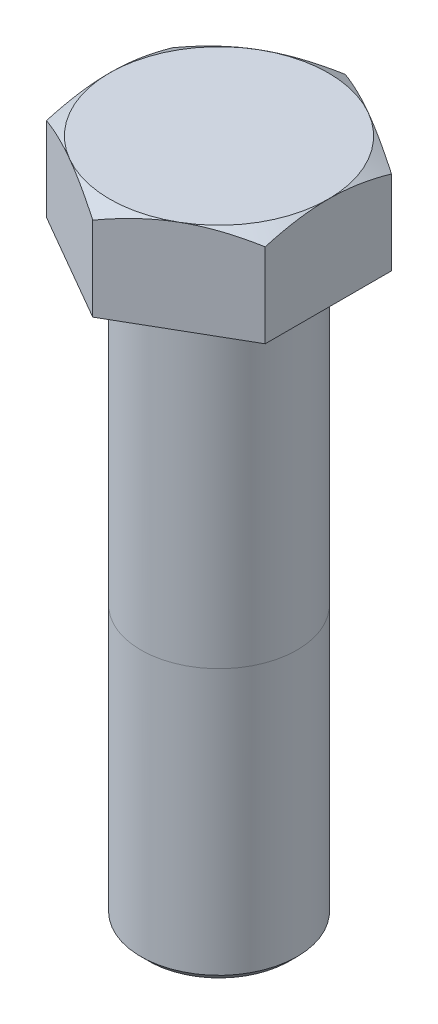
ISO-10303-21;
HEADER;
FILE_DESCRIPTION(('STEP AP214'),'2;1');
FILE_NAME('part.step','',(''),(''),'','','');
FILE_SCHEMA(('AUTOMOTIVE_DESIGN { 1 0 10303 214 1 1 1 1 }'));
ENDSEC;
DATA;
#1=APPLICATION_CONTEXT('core data for automotive mechanical design processes');
#2=APPLICATION_PROTOCOL_DEFINITION('international standard','automotive_design',2000,#1);
#3=PRODUCT_CONTEXT('',#1,'mechanical');
#4=PRODUCT('Part','Part','',(#3));
#5=PRODUCT_RELATED_PRODUCT_CATEGORY('part','',(#4));
#6=PRODUCT_DEFINITION_FORMATION('','',#4);
#7=PRODUCT_DEFINITION_CONTEXT('part definition',#1,'design');
#8=PRODUCT_DEFINITION('design','',#6,#7);
#9=PRODUCT_DEFINITION_SHAPE('','',#8);
#10=(LENGTH_UNIT() NAMED_UNIT(*) SI_UNIT(.MILLI.,.METRE.));
#11=(NAMED_UNIT(*) PLANE_ANGLE_UNIT() SI_UNIT($,.RADIAN.));
#12=(NAMED_UNIT(*) SI_UNIT($,.STERADIAN.) SOLID_ANGLE_UNIT());
#13=UNCERTAINTY_MEASURE_WITH_UNIT(LENGTH_MEASURE(1.E-05),#10,'distance_accuracy_value','');
#14=(GEOMETRIC_REPRESENTATION_CONTEXT(3) GLOBAL_UNCERTAINTY_ASSIGNED_CONTEXT((#13)) GLOBAL_UNIT_ASSIGNED_CONTEXT((#10,
#11,#12)) REPRESENTATION_CONTEXT('',''));
#15=CARTESIAN_POINT('',(0.,0.,0.));
#16=DIRECTION('',(0.,0.,1.));
#17=DIRECTION('',(1.,0.,0.));
#18=AXIS2_PLACEMENT_3D('',#15,#16,#17);
#19=CARTESIAN_POINT('',(0.,-75.,0.));
#20=DIRECTION('',(0.,1.,0.));
#21=DIRECTION('',(0.,0.,1.));
#22=AXIS2_PLACEMENT_3D('',#19,#20,#21);
#23=CYLINDRICAL_SURFACE('',#22,10.);
#24=CARTESIAN_POINT('',(0.,-74.,0.));
#25=DIRECTION('',(0.,-1.,0.));
#26=DIRECTION('',(0.,0.,-1.));
#27=AXIS2_PLACEMENT_3D('',#24,#25,#26);
#28=CIRCLE('',#27,10.);
#29=CARTESIAN_POINT('',(0.,-74.,-10.));
#30=VERTEX_POINT('',#29);
#31=EDGE_CURVE('E262',#30,#30,#28,.F.);
#32=ORIENTED_EDGE('',*,*,#31,.T.);
#33=EDGE_LOOP('',(#32));
#34=FACE_BOUND('',#33,.T.);
#35=CARTESIAN_POINT('',(0.,-40.,0.));
#36=DIRECTION('',(0.,1.,0.));
#37=DIRECTION('',(0.,0.,1.));
#38=AXIS2_PLACEMENT_3D('',#35,#36,#37);
#39=CIRCLE('',#38,10.);
#40=CARTESIAN_POINT('',(10.,-40.,0.));
#41=VERTEX_POINT('',#40);
#42=CARTESIAN_POINT('',(-10.,-40.,0.));
#43=VERTEX_POINT('',#42);
#44=EDGE_CURVE('E12',#41,#43,#39,.T.);
#45=ORIENTED_EDGE('',*,*,#44,.F.);
#46=EDGE_CURVE('E55',#43,#41,#39,.T.);
#47=ORIENTED_EDGE('',*,*,#46,.F.);
#48=EDGE_LOOP('',(#45,#47));
#49=FACE_BOUND('',#48,.T.);
#50=ADVANCED_FACE('F50',(#34,#49),#23,.T.);
#51=CARTESIAN_POINT('',(-14.,12.,8.08290376865476));
#52=DIRECTION('',(0.5,0.,-0.866025403784439));
#53=DIRECTION('',(-0.866025403784439,0.,-0.5));
#54=AXIS2_PLACEMENT_3D('',#51,#52,#53);
#55=PLANE('',#54);
#56=CARTESIAN_POINT('',(-14.0002,10.7495037679405,8.08278829860092));
#57=CARTESIAN_POINT('',(-13.6924853904181,10.8520687355185,8.26044741127663));
#58=CARTESIAN_POINT('',(-13.3835705284393,10.9499795109551,8.43879948999676));
#59=CARTESIAN_POINT('',(-12.7632636692859,11.1351989694353,8.79693382210911));
#60=CARTESIAN_POINT('',(-12.4518708930622,11.2225041654761,8.97671652528557));
#61=CARTESIAN_POINT('',(-11.8260063991707,11.3853389062415,9.33805955931008));
#62=CARTESIAN_POINT('',(-11.5115292047329,11.4608405894043,9.51962305217276));
#63=CARTESIAN_POINT('',(-10.8803895759989,11.5984470625897,9.88401168671854));
#64=CARTESIAN_POINT('',(-10.5637272674325,11.6605526168897,10.0668367558116));
#65=CARTESIAN_POINT('',(-9.93633151674918,11.7687252680104,10.429063861357));
#66=CARTESIAN_POINT('',(-9.62564465325542,11.8151503964399,10.6084390056288));
#67=CARTESIAN_POINT('',(-9.00284729327513,11.8929951265451,10.968011229064));
#68=CARTESIAN_POINT('',(-8.69073676950318,11.9244144393938,11.1482083239807));
#69=CARTESIAN_POINT('',(-8.06599141476663,11.9714542186344,11.5089052227128));
#70=CARTESIAN_POINT('',(-7.75335765114503,11.9870934589966,11.6894044102975));
#71=CARTESIAN_POINT('',(-7.12780152662096,12.0022367596143,12.0505694071847));
#72=CARTESIAN_POINT('',(-6.81487917493453,12.0017413184259,12.2312352111663));
#73=CARTESIAN_POINT('',(-6.22987230119103,11.9857422399056,12.5689890871999));
#74=CARTESIAN_POINT('',(-5.95774609067864,11.9721901053227,12.7261012280928));
#75=CARTESIAN_POINT('',(-5.41411962233189,11.9331392398875,13.0399641159314));
#76=CARTESIAN_POINT('',(-5.14261941013851,11.9076396640127,13.1967148365263));
#77=CARTESIAN_POINT('',(-4.60039240839667,11.8451385190432,13.5097697419438));
#78=CARTESIAN_POINT('',(-4.32966644468921,11.8081274502385,13.6660734499669));
#79=CARTESIAN_POINT('',(-3.78948373337593,11.7232526731859,13.9779480837552));
#80=CARTESIAN_POINT('',(-3.52002707332628,11.6753882271492,14.1335189589698));
#81=CARTESIAN_POINT('',(-2.70207638818785,11.514304872236,14.6057630072183));
#82=CARTESIAN_POINT('',(-2.15595101855752,11.3850242516312,14.9210686363857));
#83=CARTESIAN_POINT('',(-1.07184369066131,11.0916100987946,15.546978293977));
#84=CARTESIAN_POINT('',(-0.533847852112656,10.9275454762133,15.857590336186));
#85=CARTESIAN_POINT('',(0.000200000000001255,10.7495037679405,16.1659230073634));
#86=B_SPLINE_CURVE_WITH_KNOTS('',3,(#56,#57,#58,#59,#60,#61,#62,#63,#64,#65,#66,#67,#68,#69,#70,
#71,#72,#73,#74,#75,#76,#77,#78,#79,#80,#81,#82,#83,#84,#85),.UNSPECIFIED.,.F.,.F.,(4,2,2,2,2,2,
2,2,2,2,2,2,2,2,4),(0.,1.10950436744395,2.21937254652007,3.33182219257024,4.44420835421648,
5.52913815688044,6.6140888410734,7.69774720328185,8.7813720808532,9.72469383358151,
10.6680823159394,11.6122513923123,12.5564846704803,14.4864746839191,16.412676387916),.UNSPECIFIED.);
#87=CARTESIAN_POINT('',(-14.,10.7495704353215,8.0829037686548));
#88=VERTEX_POINT('',#87);
#89=CARTESIAN_POINT('',(-7.00000000000001,12.,12.1243556529821));
#90=VERTEX_POINT('',#89);
#91=EDGE_CURVE('E307',#88,#90,#86,.T.);
#92=ORIENTED_EDGE('',*,*,#91,.F.);
#93=DIRECTION('',(0.,-1.,0.));
#94=VECTOR('',#93,1.);
#95=CARTESIAN_POINT('',(-14.,12.,8.08290376865476));
#96=LINE('',#95,#94);
#97=CARTESIAN_POINT('',(-14.,0.,8.08290376865476));
#98=VERTEX_POINT('',#97);
#99=EDGE_CURVE('E283',#88,#98,#96,.T.);
#100=ORIENTED_EDGE('',*,*,#99,.T.);
#101=DIRECTION('',(0.866025403784438,0.,0.5));
#102=VECTOR('',#101,1.);
#103=CARTESIAN_POINT('',(-14.,0.,8.08290376865476));
#104=LINE('',#103,#102);
#105=CARTESIAN_POINT('',(0.,0.,16.1658075373095));
#106=VERTEX_POINT('',#105);
#107=EDGE_CURVE('E304',#98,#106,#104,.T.);
#108=ORIENTED_EDGE('',*,*,#107,.T.);
#109=DIRECTION('',(0.,-1.,0.));
#110=VECTOR('',#109,1.);
#111=CARTESIAN_POINT('',(0.,12.,16.1658075373095));
#112=LINE('',#111,#110);
#113=CARTESIAN_POINT('',(0.,10.7495704353214,16.1658075373095));
#114=VERTEX_POINT('',#113);
#115=EDGE_CURVE('E269',#114,#106,#112,.T.);
#116=ORIENTED_EDGE('',*,*,#115,.F.);
#117=EDGE_CURVE('E200',#90,#114,#86,.T.);
#118=ORIENTED_EDGE('',*,*,#117,.F.);
#119=EDGE_LOOP('',(#92,#100,#108,#116,#118));
#120=FACE_BOUND('',#119,.T.);
#121=ADVANCED_FACE('F239',(#120),#55,.F.);
#122=CARTESIAN_POINT('',(0.,12.,16.1658075373095));
#123=DIRECTION('',(-0.5,0.,-0.866025403784438));
#124=DIRECTION('',(-0.866025403784438,0.,0.500000000000001));
#125=AXIS2_PLACEMENT_3D('',#122,#123,#124);
#126=PLANE('',#125);
#127=CARTESIAN_POINT('',(-0.000199999999999032,10.7495037679405,16.1659230073634));
#128=CARTESIAN_POINT('',(0.30751460958192,10.8520687355185,15.9882638946877));
#129=CARTESIAN_POINT('',(0.616429471560718,10.9499795109551,15.8099118159675));
#130=CARTESIAN_POINT('',(1.23673633071406,11.1351989694353,15.4517774838552));
#131=CARTESIAN_POINT('',(1.54812910693776,11.2225041654761,15.2719947806787));
#132=CARTESIAN_POINT('',(2.17399360082929,11.3853389062415,14.9106517466542));
#133=CARTESIAN_POINT('',(2.48847079526713,11.4608405894043,14.7290882537915));
#134=CARTESIAN_POINT('',(3.11961042400106,11.5984470625897,14.3646996192457));
#135=CARTESIAN_POINT('',(3.43627273256745,11.6605526168897,14.1818745501527));
#136=CARTESIAN_POINT('',(4.06366848325081,11.7687252680104,13.8196474446073));
#137=CARTESIAN_POINT('',(4.37435534674457,11.8151503964399,13.6402723003355));
#138=CARTESIAN_POINT('',(4.99715270672487,11.8929951265451,13.2807000769003));
#139=CARTESIAN_POINT('',(5.30926323049682,11.9244144393938,13.1005029819836));
#140=CARTESIAN_POINT('',(5.93400858523336,11.9714542186344,12.7398060832515));
#141=CARTESIAN_POINT('',(6.24664234885496,11.9870934589966,12.5593068956668));
#142=CARTESIAN_POINT('',(6.87219847337904,12.0022367596143,12.1981418987796));
#143=CARTESIAN_POINT('',(7.18512082506546,12.0017413184259,12.017476094798));
#144=CARTESIAN_POINT('',(7.77012769880897,11.9857422399056,11.6797222187644));
#145=CARTESIAN_POINT('',(8.04225390932135,11.9721901053227,11.5226100778715));
#146=CARTESIAN_POINT('',(8.5858803776681,11.9331392398875,11.2087471900329));
#147=CARTESIAN_POINT('',(8.85738058986148,11.9076396640127,11.051996469438));
#148=CARTESIAN_POINT('',(9.39960759160332,11.8451385190432,10.7389415640205));
#149=CARTESIAN_POINT('',(9.67033355531078,11.8081274502385,10.5826378559974));
#150=CARTESIAN_POINT('',(10.2105162666241,11.7232526731859,10.2707632222091));
#151=CARTESIAN_POINT('',(10.4799729266737,11.6753882271492,10.1151923469945));
#152=CARTESIAN_POINT('',(11.2979236118121,11.514304872236,9.64294829874594));
#153=CARTESIAN_POINT('',(11.8440489814425,11.3850242516312,9.32764266957859));
#154=CARTESIAN_POINT('',(12.9281563093387,11.0916100987946,8.70173301198727));
#155=CARTESIAN_POINT('',(13.4661521478873,10.9275454762133,8.3911209697783));
#156=CARTESIAN_POINT('',(14.0002,10.7495037679405,8.08278829860092));
#157=B_SPLINE_CURVE_WITH_KNOTS('',3,(#127,#128,#129,#130,#131,#132,#133,#134,#135,#136,#137,
#138,#139,#140,#141,#142,#143,#144,#145,#146,#147,#148,#149,#150,#151,#152,#153,#154,#155,#156),
.UNSPECIFIED.,.F.,.F.,(4,2,2,2,2,2,2,2,2,2,2,2,2,2,4),(0.,1.10950436744395,2.21937254652007,
3.33182219257025,4.44420835421649,5.52913815688045,6.6140888410734,7.69774720328185,
8.78137208085321,9.72469383358151,10.6680823159394,11.6122513923123,12.5564846704803,
14.4864746839191,16.412676387916),.UNSPECIFIED.);
#158=CARTESIAN_POINT('',(7.00000000000001,12.,12.1243556529821));
#159=VERTEX_POINT('',#158);
#160=EDGE_CURVE('E314',#114,#159,#157,.T.);
#161=ORIENTED_EDGE('',*,*,#160,.F.);
#162=ORIENTED_EDGE('',*,*,#115,.T.);
#163=DIRECTION('',(0.866025403784438,0.,-0.500000000000001));
#164=VECTOR('',#163,1.);
#165=CARTESIAN_POINT('',(0.,0.,16.1658075373095));
#166=LINE('',#165,#164);
#167=CARTESIAN_POINT('',(14.,0.,8.08290376865476));
#168=VERTEX_POINT('',#167);
#169=EDGE_CURVE('E301',#106,#168,#166,.T.);
#170=ORIENTED_EDGE('',*,*,#169,.T.);
#171=DIRECTION('',(0.,-1.,0.));
#172=VECTOR('',#171,1.);
#173=CARTESIAN_POINT('',(14.,12.,8.08290376865476));
#174=LINE('',#173,#172);
#175=CARTESIAN_POINT('',(14.,10.7495704353214,8.08290376865476));
#176=VERTEX_POINT('',#175);
#177=EDGE_CURVE('E272',#176,#168,#174,.T.);
#178=ORIENTED_EDGE('',*,*,#177,.F.);
#179=EDGE_CURVE('E130',#159,#176,#157,.T.);
#180=ORIENTED_EDGE('',*,*,#179,.F.);
#181=EDGE_LOOP('',(#161,#162,#170,#178,#180));
#182=FACE_BOUND('',#181,.T.);
#183=ADVANCED_FACE('F237',(#182),#126,.F.);
#184=CARTESIAN_POINT('',(14.,12.,8.08290376865476));
#185=DIRECTION('',(-1.,0.,0.));
#186=DIRECTION('',(0.,0.,1.));
#187=AXIS2_PLACEMENT_3D('',#184,#185,#186);
#188=PLANE('',#187);
#189=CARTESIAN_POINT('',(14.,2.03488379712644,27.9498313890811));
#190=CARTESIAN_POINT('',(14.,2.37023076111288,27.3001164004974));
#191=CARTESIAN_POINT('',(14.,2.70379549218832,26.6494735941291));
#192=CARTESIAN_POINT('',(14.,3.36647218065569,25.3458869305562));
#193=CARTESIAN_POINT('',(14.,3.69558392686955,24.6929429660596));
#194=CARTESIAN_POINT('',(14.,4.34895509189266,23.3833263693378));
#195=CARTESIAN_POINT('',(14.,4.67320593445991,22.7266494511295));
#196=CARTESIAN_POINT('',(14.,5.31507219467512,21.4100681833431));
#197=CARTESIAN_POINT('',(14.,5.63268771517718,20.7501638839886));
#198=CARTESIAN_POINT('',(14.,6.27639782623187,19.391179329361));
#199=CARTESIAN_POINT('',(14.,6.60204234665205,18.6918853351432));
#200=CARTESIAN_POINT('',(14.,7.24172776898744,17.2879557164244));
#201=CARTESIAN_POINT('',(14.,7.55576820136403,16.5833198771625));
#202=CARTESIAN_POINT('',(14.,8.16867739244115,15.167908774893));
#203=CARTESIAN_POINT('',(14.,8.4675542705998,14.4571370411742));
#204=CARTESIAN_POINT('',(14.,9.04570148645688,13.0276643302037));
#205=CARTESIAN_POINT('',(14.,9.32497372517714,12.3089641296014));
#206=CARTESIAN_POINT('',(14.,9.7448279950664,11.1682733850544));
#207=CARTESIAN_POINT('',(14.,9.89407430992689,10.7494723140834));
#208=CARTESIAN_POINT('',(14.,10.1823750926574,9.90838165932031));
#209=CARTESIAN_POINT('',(14.,10.3214300364788,9.48609223946528));
#210=CARTESIAN_POINT('',(14.,10.5875993619507,8.63766324499774));
#211=CARTESIAN_POINT('',(14.,10.7147115244666,8.21152297090497));
#212=CARTESIAN_POINT('',(14.,10.9549202016765,7.35528655812801));
#213=CARTESIAN_POINT('',(14.,11.0680167434794,6.92519042709696));
#214=CARTESIAN_POINT('',(14.,11.2758840721237,6.06946764015133));
#215=CARTESIAN_POINT('',(14.,11.3709699599945,5.64391804159869));
#216=CARTESIAN_POINT('',(14.,11.5432633944381,4.78922316200008));
#217=CARTESIAN_POINT('',(14.,11.6204724976302,4.36007819739461));
#218=CARTESIAN_POINT('',(14.,11.754837881857,3.49882659547706));
#219=CARTESIAN_POINT('',(14.,11.8120030992673,3.06672136580304));
#220=CARTESIAN_POINT('',(14.,11.9044878213308,2.20016115354935));
#221=CARTESIAN_POINT('',(14.,11.939807634267,1.76570620421629));
#222=CARTESIAN_POINT('',(14.,11.9876825524609,0.889268007055268));
#223=CARTESIAN_POINT('',(14.,11.9999034228828,0.447266252123548));
#224=CARTESIAN_POINT('',(14.,12.0000954352863,-0.436742387197307));
#225=CARTESIAN_POINT('',(14.,11.9880665525097,-0.878749271591217));
#226=CARTESIAN_POINT('',(14.,11.940219694343,-1.76157137210901));
#227=CARTESIAN_POINT('',(14.,11.9043956669625,-2.20238625641703));
#228=CARTESIAN_POINT('',(14.,11.810267664243,-3.08159302766076));
#229=CARTESIAN_POINT('',(14.,11.7519631323143,-3.51998485433194));
#230=CARTESIAN_POINT('',(14.,11.6134038217897,-4.40241931971309));
#231=CARTESIAN_POINT('',(14.,11.5327256319502,-4.84639486245937));
#232=CARTESIAN_POINT('',(14.,11.3523584685403,-5.73047648575373));
#233=CARTESIAN_POINT('',(14.,11.2526676610607,-6.17058218873932));
#234=CARTESIAN_POINT('',(14.,11.0367258826044,-7.046775034194));
#235=CARTESIAN_POINT('',(14.,10.9204716039982,-7.48286135545225));
#236=CARTESIAN_POINT('',(14.,10.6737593179844,-8.35097500652423));
#237=CARTESIAN_POINT('',(14.,10.5433012422703,-8.7830023168072));
#238=CARTESIAN_POINT('',(14.,10.2734644154145,-9.63319530104946));
#239=CARTESIAN_POINT('',(14.,10.1343636924935,-10.0514496779823));
#240=CARTESIAN_POINT('',(14.,9.84632731004816,-10.8845668621142));
#241=CARTESIAN_POINT('',(14.,9.69739119741875,-11.2994295120695));
#242=CARTESIAN_POINT('',(14.,9.39112136186719,-12.1261353881979));
#243=CARTESIAN_POINT('',(14.,9.23378583131534,-12.537977942553));
#244=CARTESIAN_POINT('',(14.,8.91198598962462,-13.358854273979));
#245=CARTESIAN_POINT('',(14.,8.74752178173891,-13.7678880916329));
#246=CARTESIAN_POINT('',(14.,8.41230801263025,-14.5839202435863));
#247=CARTESIAN_POINT('',(14.,8.24155139938857,-14.9909156752664));
#248=CARTESIAN_POINT('',(14.,7.89479563942913,-15.8026699480744));
#249=CARTESIAN_POINT('',(14.,7.71879640672671,-16.20742875239));
#250=CARTESIAN_POINT('',(14.,7.18410896270162,-17.4186205811024));
#251=CARTESIAN_POINT('',(14.,6.81868431848693,-18.222081485259));
#252=CARTESIAN_POINT('',(14.,6.09600771684722,-19.7762175122285));
#253=CARTESIAN_POINT('',(14.,5.73951424702883,-20.5272475672054));
#254=CARTESIAN_POINT('',(14.,5.0172213493397,-22.0248444765253));
#255=CARTESIAN_POINT('',(14.,4.65142159755785,-22.7714111743984));
#256=CARTESIAN_POINT('',(14.,3.9137722793019,-24.2583278595973));
#257=CARTESIAN_POINT('',(14.,3.54194800035148,-24.9986904161942));
#258=CARTESIAN_POINT('',(14.,2.97985081028368,-26.1069781380862));
#259=CARTESIAN_POINT('',(14.,2.79176632306054,-26.4760158168577));
#260=CARTESIAN_POINT('',(14.,2.41427909262906,-27.2134142676695));
#261=CARTESIAN_POINT('',(14.,2.22487635557732,-27.581775042861));
#262=CARTESIAN_POINT('',(14.,2.03488379712644,-27.9498313890811));
#263=B_SPLINE_CURVE_WITH_KNOTS('',3,(#189,#190,#191,#192,#193,#194,#195,#196,#197,#198,#199,
#200,#201,#202,#203,#204,#205,#206,#207,#208,#209,#210,#211,#212,#213,#214,#215,#216,#217,#218,
#219,#220,#221,#222,#223,#224,#225,#226,#227,#228,#229,#230,#231,#232,#233,#234,#235,#236,#237,
#238,#239,#240,#241,#242,#243,#244,#245,#246,#247,#248,#249,#250,#251,#252,#253,#254,#255,#256,
#257,#258,#259,#260,#261,#262),.UNSPECIFIED.,.F.,.F.,(4,2,2,2,2,2,2,2,2,2,2,2,2,2,2,2,2,2,2,2,2,
2,2,2,2,2,2,2,2,2,2,2,2,2,2,2,4),(0.,2.19347176186133,4.38704718473205,6.58412117876421,
8.78116109065344,11.0952767189595,13.4094858814932,15.7224425113349,18.035174547799,
19.3688685705576,20.7025002681792,22.0363792850161,23.3702557218224,24.678049280889,
25.9857289211005,27.2928248012449,28.5999022351851,29.9257520686343,31.2516032557345,
32.5777917852944,33.9040131517597,35.2572819955675,36.6106814383634,37.9643515270124,
39.3180281257888,40.6402225516445,41.9624779320168,43.2850190297716,44.6075409779794,
45.9315930896242,47.2556669291279,49.9034493909698,52.3974119375353,54.8914614071462,
57.3768884544876,58.6194969900369,59.8620997261258),.UNSPECIFIED.);
#264=CARTESIAN_POINT('',(14.,12.,0.));
#265=VERTEX_POINT('',#264);
#266=EDGE_CURVE('E123',#176,#265,#263,.T.);
#267=ORIENTED_EDGE('',*,*,#266,.F.);
#268=ORIENTED_EDGE('',*,*,#177,.T.);
#269=DIRECTION('',(0.,0.,-1.));
#270=VECTOR('',#269,1.);
#271=CARTESIAN_POINT('',(14.,0.,8.08290376865476));
#272=LINE('',#271,#270);
#273=CARTESIAN_POINT('',(14.,0.,-8.08290376865476));
#274=VERTEX_POINT('',#273);
#275=EDGE_CURVE('E298',#168,#274,#272,.T.);
#276=ORIENTED_EDGE('',*,*,#275,.T.);
#277=DIRECTION('',(0.,-1.,0.));
#278=VECTOR('',#277,1.);
#279=CARTESIAN_POINT('',(14.,12.,-8.08290376865476));
#280=LINE('',#279,#278);
#281=CARTESIAN_POINT('',(14.,10.7495704353214,-8.08290376865476));
#282=VERTEX_POINT('',#281);
#283=EDGE_CURVE('E162',#282,#274,#280,.T.);
#284=ORIENTED_EDGE('',*,*,#283,.F.);
#285=EDGE_CURVE('E135',#265,#282,#263,.T.);
#286=ORIENTED_EDGE('',*,*,#285,.F.);
#287=EDGE_LOOP('',(#267,#268,#276,#284,#286));
#288=FACE_BOUND('',#287,.T.);
#289=ADVANCED_FACE('F160',(#288),#188,.F.);
#290=CARTESIAN_POINT('',(14.,12.,-8.08290376865476));
#291=DIRECTION('',(-0.5,0.,0.866025403784439));
#292=DIRECTION('',(0.866025403784439,0.,0.5));
#293=AXIS2_PLACEMENT_3D('',#290,#291,#292);
#294=PLANE('',#293);
#295=CARTESIAN_POINT('',(14.0002,10.7495037679405,-8.08278829860093));
#296=CARTESIAN_POINT('',(13.6924853904181,10.8520687355185,-8.26044741127663));
#297=CARTESIAN_POINT('',(13.3835705284393,10.9499795109551,-8.43879948999676));
#298=CARTESIAN_POINT('',(12.7632636692859,11.1351989694353,-8.79693382210912));
#299=CARTESIAN_POINT('',(12.4518708930622,11.2225041654761,-8.97671652528557));
#300=CARTESIAN_POINT('',(11.8260063991707,11.3853389062415,-9.33805955931008));
#301=CARTESIAN_POINT('',(11.5115292047329,11.4608405894043,-9.51962305217276));
#302=CARTESIAN_POINT('',(10.8803895759989,11.5984470625897,-9.88401168671854));
#303=CARTESIAN_POINT('',(10.5637272674325,11.6605526168897,-10.0668367558116));
#304=CARTESIAN_POINT('',(9.93633151674918,11.7687252680104,-10.429063861357));
#305=CARTESIAN_POINT('',(9.62564465325542,11.8151503964399,-10.6084390056288));
#306=CARTESIAN_POINT('',(9.00284729327513,11.8929951265451,-10.968011229064));
#307=CARTESIAN_POINT('',(8.69073676950318,11.9244144393938,-11.1482083239807));
#308=CARTESIAN_POINT('',(8.06599141476663,11.9714542186344,-11.5089052227128));
#309=CARTESIAN_POINT('',(7.75335765114504,11.9870934589966,-11.6894044102975));
#310=CARTESIAN_POINT('',(7.12780152662096,12.0022367596143,-12.0505694071847));
#311=CARTESIAN_POINT('',(6.81487917493453,12.0017413184259,-12.2312352111663));
#312=CARTESIAN_POINT('',(6.22987230119103,11.9857422399056,-12.5689890871999));
#313=CARTESIAN_POINT('',(5.95774609067865,11.9721901053227,-12.7261012280928));
#314=CARTESIAN_POINT('',(5.41411962233189,11.9331392398875,-13.0399641159314));
#315=CARTESIAN_POINT('',(5.14261941013851,11.9076396640127,-13.1967148365263));
#316=CARTESIAN_POINT('',(4.60039240839667,11.8451385190432,-13.5097697419438));
#317=CARTESIAN_POINT('',(4.32966644468922,11.8081274502385,-13.6660734499669));
#318=CARTESIAN_POINT('',(3.78948373337593,11.7232526731859,-13.9779480837552));
#319=CARTESIAN_POINT('',(3.52002707332628,11.6753882271492,-14.1335189589698));
#320=CARTESIAN_POINT('',(2.70207638818785,11.514304872236,-14.6057630072183));
#321=CARTESIAN_POINT('',(2.15595101855753,11.3850242516312,-14.9210686363857));
#322=CARTESIAN_POINT('',(1.07184369066131,11.0916100987946,-15.546978293977));
#323=CARTESIAN_POINT('',(0.533847852112659,10.9275454762133,-15.857590336186));
#324=CARTESIAN_POINT('',(-0.000199999999998708,10.7495037679405,-16.1659230073634));
#325=B_SPLINE_CURVE_WITH_KNOTS('',3,(#295,#296,#297,#298,#299,#300,#301,#302,#303,#304,#305,
#306,#307,#308,#309,#310,#311,#312,#313,#314,#315,#316,#317,#318,#319,#320,#321,#322,#323,#324),
.UNSPECIFIED.,.F.,.F.,(4,2,2,2,2,2,2,2,2,2,2,2,2,2,4),(0.,1.10950436744395,2.21937254652007,
3.33182219257025,4.44420835421649,5.52913815688045,6.6140888410734,7.69774720328185,
8.78137208085321,9.72469383358151,10.6680823159394,11.6122513923123,12.5564846704803,
14.4864746839191,16.412676387916),.UNSPECIFIED.);
#326=CARTESIAN_POINT('',(7.,12.,-12.1243556529821));
#327=VERTEX_POINT('',#326);
#328=EDGE_CURVE('E142',#282,#327,#325,.T.);
#329=ORIENTED_EDGE('',*,*,#328,.F.);
#330=ORIENTED_EDGE('',*,*,#283,.T.);
#331=DIRECTION('',(-0.866025403784438,0.,-0.5));
#332=VECTOR('',#331,1.);
#333=CARTESIAN_POINT('',(14.,0.,-8.08290376865476));
#334=LINE('',#333,#332);
#335=CARTESIAN_POINT('',(0.,0.,-16.1658075373095));
#336=VERTEX_POINT('',#335);
#337=EDGE_CURVE('E294',#274,#336,#334,.T.);
#338=ORIENTED_EDGE('',*,*,#337,.T.);
#339=DIRECTION('',(0.,-1.,0.));
#340=VECTOR('',#339,1.);
#341=CARTESIAN_POINT('',(0.,12.,-16.1658075373095));
#342=LINE('',#341,#340);
#343=CARTESIAN_POINT('',(0.,10.7495704353214,-16.1658075373095));
#344=VERTEX_POINT('',#343);
#345=EDGE_CURVE('E277',#344,#336,#342,.T.);
#346=ORIENTED_EDGE('',*,*,#345,.F.);
#347=EDGE_CURVE('E165',#327,#344,#325,.T.);
#348=ORIENTED_EDGE('',*,*,#347,.F.);
#349=EDGE_LOOP('',(#329,#330,#338,#346,#348));
#350=FACE_BOUND('',#349,.T.);
#351=ADVANCED_FACE('F228',(#350),#294,.F.);
#352=CARTESIAN_POINT('',(0.,12.,-16.1658075373095));
#353=DIRECTION('',(0.5,0.,0.866025403784438));
#354=DIRECTION('',(0.866025403784439,0.,-0.5));
#355=AXIS2_PLACEMENT_3D('',#352,#353,#354);
#356=PLANE('',#355);
#357=CARTESIAN_POINT('',(0.000200000000003174,10.7495037679405,-16.1659230073634));
#358=CARTESIAN_POINT('',(-0.307514609581917,10.8520687355185,-15.9882638946877));
#359=CARTESIAN_POINT('',(-0.616429471560716,10.9499795109551,-15.8099118159675));
#360=CARTESIAN_POINT('',(-1.23673633071406,11.1351989694353,-15.4517774838552));
#361=CARTESIAN_POINT('',(-1.54812910693775,11.2225041654761,-15.2719947806787));
#362=CARTESIAN_POINT('',(-2.17399360082929,11.3853389062415,-14.9106517466542));
#363=CARTESIAN_POINT('',(-2.48847079526713,11.4608405894043,-14.7290882537915));
#364=CARTESIAN_POINT('',(-3.11961042400106,11.5984470625897,-14.3646996192457));
#365=CARTESIAN_POINT('',(-3.43627273256745,11.6605526168897,-14.1818745501527));
#366=CARTESIAN_POINT('',(-4.06366848325081,11.7687252680104,-13.8196474446073));
#367=CARTESIAN_POINT('',(-4.37435534674457,11.8151503964399,-13.6402723003355));
#368=CARTESIAN_POINT('',(-4.99715270672486,11.8929951265451,-13.2807000769003));
#369=CARTESIAN_POINT('',(-5.30926323049682,11.9244144393938,-13.1005029819836));
#370=CARTESIAN_POINT('',(-5.93400858523336,11.9714542186344,-12.7398060832515));
#371=CARTESIAN_POINT('',(-6.24664234885496,11.9870934589966,-12.5593068956668));
#372=CARTESIAN_POINT('',(-6.87219847337903,12.0022367596143,-12.1981418987796));
#373=CARTESIAN_POINT('',(-7.18512082506546,12.0017413184259,-12.017476094798));
#374=CARTESIAN_POINT('',(-7.77012769880897,11.9857422399056,-11.6797222187644));
#375=CARTESIAN_POINT('',(-8.04225390932135,11.9721901053227,-11.5226100778715));
#376=CARTESIAN_POINT('',(-8.5858803776681,11.9331392398875,-11.2087471900329));
#377=CARTESIAN_POINT('',(-8.85738058986148,11.9076396640127,-11.051996469438));
#378=CARTESIAN_POINT('',(-9.39960759160332,11.8451385190432,-10.7389415640205));
#379=CARTESIAN_POINT('',(-9.67033355531078,11.8081274502385,-10.5826378559974));
#380=CARTESIAN_POINT('',(-10.2105162666241,11.7232526731859,-10.2707632222091));
#381=CARTESIAN_POINT('',(-10.4799729266737,11.6753882271492,-10.1151923469945));
#382=CARTESIAN_POINT('',(-11.2979236118121,11.514304872236,-9.64294829874595));
#383=CARTESIAN_POINT('',(-11.8440489814425,11.3850242516312,-9.3276426695786));
#384=CARTESIAN_POINT('',(-12.9281563093387,11.0916100987946,-8.70173301198727));
#385=CARTESIAN_POINT('',(-13.4661521478873,10.9275454762133,-8.3911209697783));
#386=CARTESIAN_POINT('',(-14.0002,10.7495037679405,-8.08278829860092));
#387=B_SPLINE_CURVE_WITH_KNOTS('',3,(#357,#358,#359,#360,#361,#362,#363,#364,#365,#366,#367,
#368,#369,#370,#371,#372,#373,#374,#375,#376,#377,#378,#379,#380,#381,#382,#383,#384,#385,#386),
.UNSPECIFIED.,.F.,.F.,(4,2,2,2,2,2,2,2,2,2,2,2,2,2,4),(0.,1.10950436744395,2.21937254652007,
3.33182219257025,4.44420835421649,5.52913815688045,6.6140888410734,7.69774720328185,
8.78137208085321,9.72469383358151,10.6680823159394,11.6122513923123,12.5564846704803,
14.4864746839191,16.412676387916),.UNSPECIFIED.);
#388=CARTESIAN_POINT('',(-7.,12.,-12.1243556529821));
#389=VERTEX_POINT('',#388);
#390=EDGE_CURVE('E222',#344,#389,#387,.T.);
#391=ORIENTED_EDGE('',*,*,#390,.F.);
#392=ORIENTED_EDGE('',*,*,#345,.T.);
#393=DIRECTION('',(-0.866025403784439,0.,0.5));
#394=VECTOR('',#393,1.);
#395=CARTESIAN_POINT('',(0.,0.,-16.1658075373095));
#396=LINE('',#395,#394);
#397=CARTESIAN_POINT('',(-14.,0.,-8.08290376865476));
#398=VERTEX_POINT('',#397);
#399=EDGE_CURVE('E290',#336,#398,#396,.T.);
#400=ORIENTED_EDGE('',*,*,#399,.T.);
#401=DIRECTION('',(0.,-1.,0.));
#402=VECTOR('',#401,1.);
#403=CARTESIAN_POINT('',(-14.,12.,-8.08290376865476));
#404=LINE('',#403,#402);
#405=CARTESIAN_POINT('',(-14.,10.7495704353214,-8.08290376865476));
#406=VERTEX_POINT('',#405);
#407=EDGE_CURVE('E280',#406,#398,#404,.T.);
#408=ORIENTED_EDGE('',*,*,#407,.F.);
#409=EDGE_CURVE('E215',#389,#406,#387,.T.);
#410=ORIENTED_EDGE('',*,*,#409,.F.);
#411=EDGE_LOOP('',(#391,#392,#400,#408,#410));
#412=FACE_BOUND('',#411,.T.);
#413=ADVANCED_FACE('F224',(#412),#356,.F.);
#414=CARTESIAN_POINT('',(-14.,12.,-8.08290376865476));
#415=DIRECTION('',(1.,0.,0.));
#416=DIRECTION('',(0.,0.,-1.));
#417=AXIS2_PLACEMENT_3D('',#414,#415,#416);
#418=PLANE('',#417);
#419=CARTESIAN_POINT('',(-14.,2.03488379712644,-27.9498313890811));
#420=CARTESIAN_POINT('',(-14.,2.37023076111288,-27.3001164004974));
#421=CARTESIAN_POINT('',(-14.,2.70379549218832,-26.6494735941291));
#422=CARTESIAN_POINT('',(-14.,3.36647218065569,-25.3458869305562));
#423=CARTESIAN_POINT('',(-14.,3.69558392686955,-24.6929429660596));
#424=CARTESIAN_POINT('',(-14.,4.34895509189266,-23.3833263693378));
#425=CARTESIAN_POINT('',(-14.,4.67320593445991,-22.7266494511295));
#426=CARTESIAN_POINT('',(-14.,5.31507219467511,-21.4100681833431));
#427=CARTESIAN_POINT('',(-14.,5.63268771517717,-20.7501638839886));
#428=CARTESIAN_POINT('',(-14.,6.27639782623187,-19.391179329361));
#429=CARTESIAN_POINT('',(-14.,6.60204234665205,-18.6918853351432));
#430=CARTESIAN_POINT('',(-14.,7.24172776898743,-17.2879557164244));
#431=CARTESIAN_POINT('',(-14.,7.55576820136403,-16.5833198771625));
#432=CARTESIAN_POINT('',(-14.,8.16867739244114,-15.167908774893));
#433=CARTESIAN_POINT('',(-14.,8.4675542705998,-14.4571370411742));
#434=CARTESIAN_POINT('',(-14.,9.04570148645687,-13.0276643302037));
#435=CARTESIAN_POINT('',(-14.,9.32497372517714,-12.3089641296015));
#436=CARTESIAN_POINT('',(-14.,9.7448279950664,-11.1682733850544));
#437=CARTESIAN_POINT('',(-14.,9.89407430992689,-10.7494723140834));
#438=CARTESIAN_POINT('',(-14.,10.1823750926574,-9.90838165932031));
#439=CARTESIAN_POINT('',(-14.,10.3214300364788,-9.48609223946529));
#440=CARTESIAN_POINT('',(-14.,10.5875993619507,-8.63766324499774));
#441=CARTESIAN_POINT('',(-14.,10.7147115244666,-8.21152297090498));
#442=CARTESIAN_POINT('',(-14.,10.9549202016765,-7.35528655812802));
#443=CARTESIAN_POINT('',(-14.,11.0680167434794,-6.92519042709697));
#444=CARTESIAN_POINT('',(-14.,11.2758840721237,-6.06946764015134));
#445=CARTESIAN_POINT('',(-14.,11.3709699599945,-5.6439180415987));
#446=CARTESIAN_POINT('',(-14.,11.5432633944381,-4.78922316200009));
#447=CARTESIAN_POINT('',(-14.,11.6204724976302,-4.36007819739461));
#448=CARTESIAN_POINT('',(-14.,11.754837881857,-3.49882659547706));
#449=CARTESIAN_POINT('',(-14.,11.8120030992673,-3.06672136580304));
#450=CARTESIAN_POINT('',(-14.,11.9044878213308,-2.20016115354935));
#451=CARTESIAN_POINT('',(-14.,11.939807634267,-1.76570620421629));
#452=CARTESIAN_POINT('',(-14.,11.9876825524609,-0.88926800705527));
#453=CARTESIAN_POINT('',(-14.,11.9999034228828,-0.447266252123548));
#454=CARTESIAN_POINT('',(-14.,12.0000954352863,0.436742387197306));
#455=CARTESIAN_POINT('',(-14.,11.9880665525097,0.878749271591215));
#456=CARTESIAN_POINT('',(-14.,11.940219694343,1.76157137210901));
#457=CARTESIAN_POINT('',(-14.,11.9043956669625,2.20238625641703));
#458=CARTESIAN_POINT('',(-14.,11.810267664243,3.08159302766076));
#459=CARTESIAN_POINT('',(-14.,11.7519631323143,3.51998485433194));
#460=CARTESIAN_POINT('',(-14.,11.6134038217897,4.40241931971308));
#461=CARTESIAN_POINT('',(-14.,11.5327256319502,4.84639486245936));
#462=CARTESIAN_POINT('',(-14.,11.3523584685403,5.73047648575372));
#463=CARTESIAN_POINT('',(-14.,11.2526676610607,6.17058218873931));
#464=CARTESIAN_POINT('',(-14.,11.0367258826044,7.046775034194));
#465=CARTESIAN_POINT('',(-14.,10.9204716039982,7.48286135545225));
#466=CARTESIAN_POINT('',(-14.,10.6737593179844,8.35097500652423));
#467=CARTESIAN_POINT('',(-14.,10.5433012422703,8.7830023168072));
#468=CARTESIAN_POINT('',(-14.,10.2734644154145,9.63319530104946));
#469=CARTESIAN_POINT('',(-14.,10.1343636924935,10.0514496779823));
#470=CARTESIAN_POINT('',(-14.,9.84632731004816,10.8845668621142));
#471=CARTESIAN_POINT('',(-14.,9.69739119741875,11.2994295120695));
#472=CARTESIAN_POINT('',(-14.,9.39112136186719,12.1261353881979));
#473=CARTESIAN_POINT('',(-14.,9.23378583131534,12.537977942553));
#474=CARTESIAN_POINT('',(-14.,8.91198598962462,13.358854273979));
#475=CARTESIAN_POINT('',(-14.,8.74752178173891,13.7678880916329));
#476=CARTESIAN_POINT('',(-14.,8.41230801263025,14.5839202435863));
#477=CARTESIAN_POINT('',(-14.,8.24155139938857,14.9909156752664));
#478=CARTESIAN_POINT('',(-14.,7.89479563942913,15.8026699480744));
#479=CARTESIAN_POINT('',(-14.,7.71879640672671,16.20742875239));
#480=CARTESIAN_POINT('',(-14.,7.18410896270162,17.4186205811024));
#481=CARTESIAN_POINT('',(-14.,6.81868431848693,18.222081485259));
#482=CARTESIAN_POINT('',(-14.,6.09600771684722,19.7762175122285));
#483=CARTESIAN_POINT('',(-14.,5.73951424702884,20.5272475672054));
#484=CARTESIAN_POINT('',(-14.,5.01722134933971,22.0248444765253));
#485=CARTESIAN_POINT('',(-14.,4.65142159755785,22.7714111743984));
#486=CARTESIAN_POINT('',(-14.,3.9137722793019,24.2583278595973));
#487=CARTESIAN_POINT('',(-14.,3.54194800035149,24.9986904161943));
#488=CARTESIAN_POINT('',(-14.,2.97985081028368,26.1069781380862));
#489=CARTESIAN_POINT('',(-14.,2.79176632306055,26.4760158168577));
#490=CARTESIAN_POINT('',(-14.,2.41427909262906,27.2134142676695));
#491=CARTESIAN_POINT('',(-14.,2.22487635557732,27.581775042861));
#492=CARTESIAN_POINT('',(-14.,2.03488379712644,27.9498313890811));
#493=B_SPLINE_CURVE_WITH_KNOTS('',3,(#419,#420,#421,#422,#423,#424,#425,#426,#427,#428,#429,
#430,#431,#432,#433,#434,#435,#436,#437,#438,#439,#440,#441,#442,#443,#444,#445,#446,#447,#448,
#449,#450,#451,#452,#453,#454,#455,#456,#457,#458,#459,#460,#461,#462,#463,#464,#465,#466,#467,
#468,#469,#470,#471,#472,#473,#474,#475,#476,#477,#478,#479,#480,#481,#482,#483,#484,#485,#486,
#487,#488,#489,#490,#491,#492),.UNSPECIFIED.,.F.,.F.,(4,2,2,2,2,2,2,2,2,2,2,2,2,2,2,2,2,2,2,2,2,
2,2,2,2,2,2,2,2,2,2,2,2,2,2,2,4),(0.,2.19347176186133,4.38704718473205,6.58412117876421,
8.78116109065344,11.0952767189595,13.4094858814932,15.7224425113349,18.035174547799,
19.3688685705576,20.7025002681792,22.0363792850161,23.3702557218224,24.678049280889,
25.9857289211005,27.2928248012449,28.5999022351851,29.9257520686343,31.2516032557345,
32.5777917852944,33.9040131517597,35.2572819955675,36.6106814383634,37.9643515270124,
39.3180281257888,40.6402225516445,41.9624779320168,43.2850190297716,44.6075409779794,
45.9315930896242,47.2556669291279,49.9034493909699,52.3974119375353,54.8914614071462,
57.3768884544876,58.6194969900369,59.8620997261258),.UNSPECIFIED.);
#494=CARTESIAN_POINT('',(-14.,12.,0.));
#495=VERTEX_POINT('',#494);
#496=EDGE_CURVE('E223',#406,#495,#493,.T.);
#497=ORIENTED_EDGE('',*,*,#496,.F.);
#498=ORIENTED_EDGE('',*,*,#407,.T.);
#499=DIRECTION('',(0.,0.,1.));
#500=VECTOR('',#499,1.);
#501=CARTESIAN_POINT('',(-14.,0.,-8.08290376865476));
#502=LINE('',#501,#500);
#503=EDGE_CURVE('E286',#398,#98,#502,.T.);
#504=ORIENTED_EDGE('',*,*,#503,.T.);
#505=ORIENTED_EDGE('',*,*,#99,.F.);
#506=EDGE_CURVE('E157',#495,#88,#493,.T.);
#507=ORIENTED_EDGE('',*,*,#506,.F.);
#508=EDGE_LOOP('',(#497,#498,#504,#505,#507));
#509=FACE_BOUND('',#508,.T.);
#510=ADVANCED_FACE('F227',(#509),#418,.F.);
#511=CARTESIAN_POINT('',(0.,0.,0.));
#512=DIRECTION('',(0.,1.,0.));
#513=DIRECTION('',(0.,0.,1.));
#514=AXIS2_PLACEMENT_3D('',#511,#512,#513);
#515=PLANE('',#514);
#516=CARTESIAN_POINT('',(0.,0.,0.));
#517=DIRECTION('',(0.,-1.,0.));
#518=DIRECTION('',(0.,0.,-1.));
#519=AXIS2_PLACEMENT_3D('',#516,#517,#518);
#520=CIRCLE('',#519,10.);
#521=CARTESIAN_POINT('',(0.,0.,-10.));
#522=VERTEX_POINT('',#521);
#523=EDGE_CURVE('E148',#522,#522,#520,.T.);
#524=ORIENTED_EDGE('',*,*,#523,.F.);
#525=EDGE_LOOP('',(#524));
#526=FACE_BOUND('',#525,.T.);
#527=ORIENTED_EDGE('',*,*,#107,.F.);
#528=ORIENTED_EDGE('',*,*,#503,.F.);
#529=ORIENTED_EDGE('',*,*,#399,.F.);
#530=ORIENTED_EDGE('',*,*,#337,.F.);
#531=ORIENTED_EDGE('',*,*,#275,.F.);
#532=ORIENTED_EDGE('',*,*,#169,.F.);
#533=EDGE_LOOP('',(#527,#528,#529,#530,#531,#532));
#534=FACE_BOUND('',#533,.T.);
#535=ADVANCED_FACE('F330',(#526,#534),#515,.F.);
#536=CARTESIAN_POINT('',(0.,12.,0.));
#537=DIRECTION('',(0.,-1.,0.));
#538=DIRECTION('',(0.,0.,1.));
#539=AXIS2_PLACEMENT_3D('',#536,#537,#538);
#540=CONICAL_SURFACE('',#539,14.,1.0471975511966);
#541=ORIENTED_EDGE('',*,*,#117,.T.);
#542=ORIENTED_EDGE('',*,*,#160,.T.);
#543=CARTESIAN_POINT('',(0.,12.,0.));
#544=DIRECTION('',(0.,1.,0.));
#545=DIRECTION('',(0.,0.,1.));
#546=AXIS2_PLACEMENT_3D('',#543,#544,#545);
#547=CIRCLE('',#546,14.);
#548=EDGE_CURVE('E151',#90,#159,#547,.T.);
#549=ORIENTED_EDGE('',*,*,#548,.F.);
#550=EDGE_LOOP('',(#541,#542,#549));
#551=FACE_BOUND('',#550,.T.);
#552=ADVANCED_FACE('F193',(#551),#540,.T.);
#553=ORIENTED_EDGE('',*,*,#91,.T.);
#554=EDGE_CURVE('E268',#495,#90,#547,.T.);
#555=ORIENTED_EDGE('',*,*,#554,.F.);
#556=ORIENTED_EDGE('',*,*,#506,.T.);
#557=EDGE_LOOP('',(#553,#555,#556));
#558=FACE_BOUND('',#557,.T.);
#559=ADVANCED_FACE('F187',(#558),#540,.T.);
#560=ORIENTED_EDGE('',*,*,#409,.T.);
#561=ORIENTED_EDGE('',*,*,#496,.T.);
#562=EDGE_CURVE('E343',#389,#495,#547,.T.);
#563=ORIENTED_EDGE('',*,*,#562,.F.);
#564=EDGE_LOOP('',(#560,#561,#563));
#565=FACE_BOUND('',#564,.T.);
#566=ADVANCED_FACE('F192',(#565),#540,.T.);
#567=ORIENTED_EDGE('',*,*,#347,.T.);
#568=ORIENTED_EDGE('',*,*,#390,.T.);
#569=EDGE_CURVE('E149',#327,#389,#547,.T.);
#570=ORIENTED_EDGE('',*,*,#569,.F.);
#571=EDGE_LOOP('',(#567,#568,#570));
#572=FACE_BOUND('',#571,.T.);
#573=ADVANCED_FACE('F339',(#572),#540,.T.);
#574=ORIENTED_EDGE('',*,*,#285,.T.);
#575=ORIENTED_EDGE('',*,*,#328,.T.);
#576=EDGE_CURVE('E139',#265,#327,#547,.T.);
#577=ORIENTED_EDGE('',*,*,#576,.F.);
#578=EDGE_LOOP('',(#574,#575,#577));
#579=FACE_BOUND('',#578,.T.);
#580=ADVANCED_FACE('F140',(#579),#540,.T.);
#581=ORIENTED_EDGE('',*,*,#179,.T.);
#582=ORIENTED_EDGE('',*,*,#266,.T.);
#583=CARTESIAN_POINT('',(0.,12.,0.));
#584=DIRECTION('',(0.,1.,0.));
#585=DIRECTION('',(0.,0.,1.));
#586=AXIS2_PLACEMENT_3D('',#583,#584,#585);
#587=CIRCLE('',#586,14.);
#588=EDGE_CURVE('E127',#159,#265,#587,.T.);
#589=ORIENTED_EDGE('',*,*,#588,.F.);
#590=EDGE_LOOP('',(#581,#582,#589));
#591=FACE_BOUND('',#590,.T.);
#592=ADVANCED_FACE('F125',(#591),#540,.T.);
#593=CARTESIAN_POINT('',(0.,12.,0.));
#594=DIRECTION('',(0.,1.,0.));
#595=DIRECTION('',(0.,0.,1.));
#596=AXIS2_PLACEMENT_3D('',#593,#594,#595);
#597=PLANE('',#596);
#598=ORIENTED_EDGE('',*,*,#548,.T.);
#599=ORIENTED_EDGE('',*,*,#588,.T.);
#600=ORIENTED_EDGE('',*,*,#576,.T.);
#601=ORIENTED_EDGE('',*,*,#569,.T.);
#602=ORIENTED_EDGE('',*,*,#562,.T.);
#603=ORIENTED_EDGE('',*,*,#554,.T.);
#604=EDGE_LOOP('',(#598,#599,#600,#601,#602,#603));
#605=FACE_BOUND('',#604,.T.);
#606=ADVANCED_FACE('F153',(#605),#597,.T.);
#607=ORIENTED_EDGE('',*,*,#46,.T.);
#608=ORIENTED_EDGE('',*,*,#44,.T.);
#609=EDGE_LOOP('',(#607,#608));
#610=FACE_BOUND('',#609,.T.);
#611=ORIENTED_EDGE('',*,*,#523,.T.);
#612=EDGE_LOOP('',(#611));
#613=FACE_BOUND('',#612,.T.);
#614=ADVANCED_FACE('F195',(#610,#613),#23,.T.);
#615=CARTESIAN_POINT('',(0.,-75.,0.));
#616=DIRECTION('',(0.,-1.,0.));
#617=DIRECTION('',(0.,0.,-1.));
#618=AXIS2_PLACEMENT_3D('',#615,#616,#617);
#619=PLANE('',#618);
#620=CARTESIAN_POINT('',(0.,-75.,0.));
#621=DIRECTION('',(0.,-1.,0.));
#622=DIRECTION('',(0.,0.,-1.));
#623=AXIS2_PLACEMENT_3D('',#620,#621,#622);
#624=CIRCLE('',#623,8.99999999999999);
#625=CARTESIAN_POINT('',(0.,-75.,-8.99999999999999));
#626=VERTEX_POINT('',#625);
#627=EDGE_CURVE('E258',#626,#626,#624,.T.);
#628=ORIENTED_EDGE('',*,*,#627,.T.);
#629=EDGE_LOOP('',(#628));
#630=FACE_BOUND('',#629,.T.);
#631=ADVANCED_FACE('F247',(#630),#619,.T.);
#632=CARTESIAN_POINT('',(0.,-75.,0.));
#633=DIRECTION('',(0.,1.,0.));
#634=DIRECTION('',(0.,0.,1.));
#635=AXIS2_PLACEMENT_3D('',#632,#633,#634);
#636=CONICAL_SURFACE('',#635,8.99999999999999,0.785398163397451);
#637=ORIENTED_EDGE('',*,*,#31,.F.);
#638=EDGE_LOOP('',(#637));
#639=FACE_BOUND('',#638,.T.);
#640=ORIENTED_EDGE('',*,*,#627,.F.);
#641=EDGE_LOOP('',(#640));
#642=FACE_BOUND('',#641,.T.);
#643=ADVANCED_FACE('F53',(#639,#642),#636,.T.);
#644=CLOSED_SHELL('',(#50,#121,#183,#289,#351,#413,#510,#535,#552,#559,#566,#573,#580,#592,#606,
#614,#631,#643));
#645=MANIFOLD_SOLID_BREP('B2',#644);
#646=ADVANCED_BREP_SHAPE_REPRESENTATION('',(#18,#645),#14);
#647=SHAPE_DEFINITION_REPRESENTATION(#9,#646);
ENDSEC;
END-ISO-10303-21;
